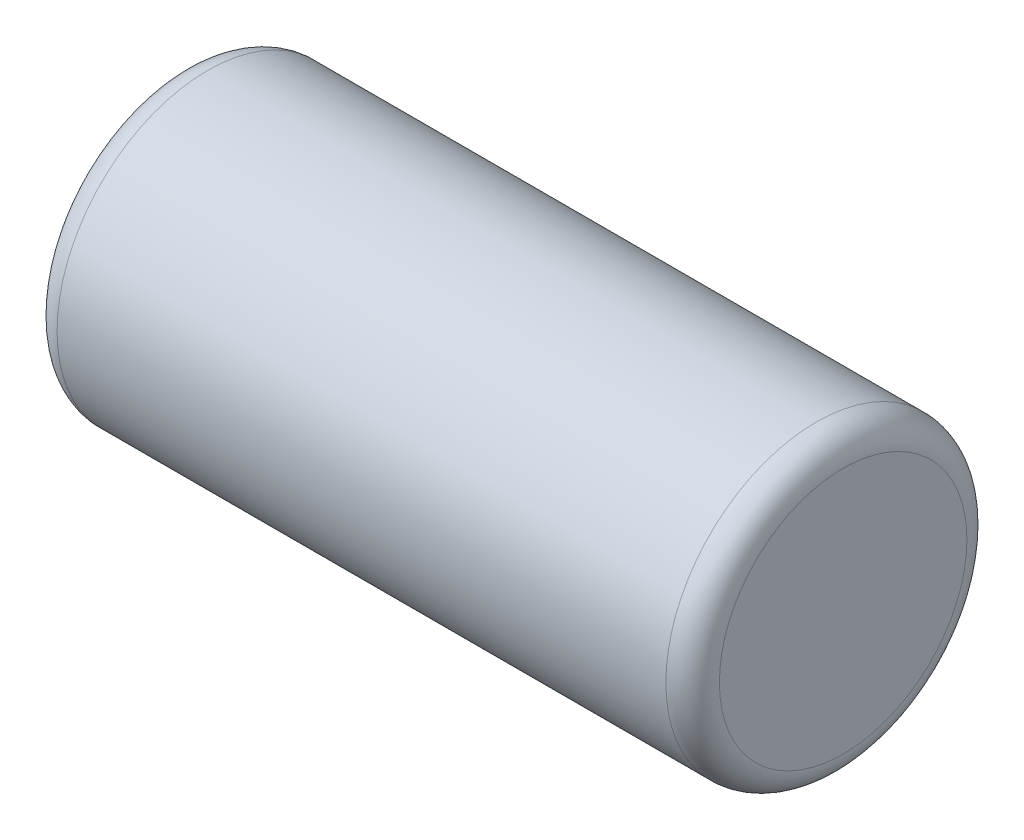
ISO-10303-21;
HEADER;
FILE_DESCRIPTION(('STEP AP214'),'2;1');
FILE_NAME('part.step','',(''),(''),'','','');
FILE_SCHEMA(('AUTOMOTIVE_DESIGN { 1 0 10303 214 1 1 1 1 }'));
ENDSEC;
DATA;
#1=APPLICATION_CONTEXT('core data for automotive mechanical design processes');
#2=APPLICATION_PROTOCOL_DEFINITION('international standard','automotive_design',2000,#1);
#3=PRODUCT_CONTEXT('',#1,'mechanical');
#4=PRODUCT('Part','Part','',(#3));
#5=PRODUCT_RELATED_PRODUCT_CATEGORY('part','',(#4));
#6=PRODUCT_DEFINITION_FORMATION('','',#4);
#7=PRODUCT_DEFINITION_CONTEXT('part definition',#1,'design');
#8=PRODUCT_DEFINITION('design','',#6,#7);
#9=PRODUCT_DEFINITION_SHAPE('','',#8);
#10=(LENGTH_UNIT() NAMED_UNIT(*) SI_UNIT(.MILLI.,.METRE.));
#11=(NAMED_UNIT(*) PLANE_ANGLE_UNIT() SI_UNIT($,.RADIAN.));
#12=(NAMED_UNIT(*) SI_UNIT($,.STERADIAN.) SOLID_ANGLE_UNIT());
#13=UNCERTAINTY_MEASURE_WITH_UNIT(LENGTH_MEASURE(1.E-05),#10,'distance_accuracy_value','');
#14=(GEOMETRIC_REPRESENTATION_CONTEXT(3) GLOBAL_UNCERTAINTY_ASSIGNED_CONTEXT((#13)) GLOBAL_UNIT_ASSIGNED_CONTEXT((#10,
#11,#12)) REPRESENTATION_CONTEXT('',''));
#15=CARTESIAN_POINT('',(0.,0.,0.));
#16=DIRECTION('',(0.,0.,1.));
#17=DIRECTION('',(1.,0.,0.));
#18=AXIS2_PLACEMENT_3D('',#15,#16,#17);
#19=CARTESIAN_POINT('',(1.35,3.75,0.));
#20=DIRECTION('',(1.,0.,0.));
#21=DIRECTION('',(0.,0.,-1.));
#22=AXIS2_PLACEMENT_3D('',#19,#20,#21);
#23=PLANE('',#22);
#24=CARTESIAN_POINT('',(1.35,3.75,0.));
#25=DIRECTION('',(-1.,0.,0.));
#26=DIRECTION('',(0.,0.,1.));
#27=AXIS2_PLACEMENT_3D('',#24,#25,#26);
#28=CIRCLE('',#27,0.6166666666667);
#29=CARTESIAN_POINT('',(1.35,3.75,0.6166666666667));
#30=VERTEX_POINT('',#29);
#31=EDGE_CURVE('E10',#30,#30,#28,.T.);
#32=ORIENTED_EDGE('',*,*,#31,.T.);
#33=EDGE_LOOP('',(#32));
#34=FACE_BOUND('',#33,.T.);
#35=ADVANCED_FACE('F31',(#34),#23,.F.);
#36=CARTESIAN_POINT('',(1.48333333333324,3.75,0.));
#37=DIRECTION('',(-1.,0.,0.));
#38=DIRECTION('',(0.,0.,1.));
#39=AXIS2_PLACEMENT_3D('',#36,#37,#38);
#40=TOROIDAL_SURFACE('',#39,0.61666666666676,0.13333333333324);
#41=ORIENTED_EDGE('',*,*,#31,.F.);
#42=EDGE_LOOP('',(#41));
#43=FACE_BOUND('',#42,.T.);
#44=CARTESIAN_POINT('',(1.4833333333333,3.75,0.));
#45=DIRECTION('',(-1.,0.,0.));
#46=DIRECTION('',(0.,0.,1.));
#47=AXIS2_PLACEMENT_3D('',#44,#45,#46);
#48=CIRCLE('',#47,0.75);
#49=CARTESIAN_POINT('',(1.4833333333333,3.75,0.75));
#50=VERTEX_POINT('',#49);
#51=EDGE_CURVE('E37',#50,#50,#48,.T.);
#52=ORIENTED_EDGE('',*,*,#51,.T.);
#53=EDGE_LOOP('',(#52));
#54=FACE_BOUND('',#53,.T.);
#55=ADVANCED_FACE('F63',(#43,#54),#40,.T.);
#56=CARTESIAN_POINT('',(50.,3.75,0.));
#57=DIRECTION('',(-1.,0.,0.));
#58=DIRECTION('',(0.,0.,1.));
#59=AXIS2_PLACEMENT_3D('',#56,#57,#58);
#60=CYLINDRICAL_SURFACE('',#59,0.75);
#61=ORIENTED_EDGE('',*,*,#51,.F.);
#62=EDGE_LOOP('',(#61));
#63=FACE_BOUND('',#62,.T.);
#64=CARTESIAN_POINT('',(4.5166666666667,3.75,0.));
#65=DIRECTION('',(-1.,0.,0.));
#66=DIRECTION('',(0.,0.,1.));
#67=AXIS2_PLACEMENT_3D('',#64,#65,#66);
#68=CIRCLE('',#67,0.75);
#69=CARTESIAN_POINT('',(4.5166666666667,3.75,0.75));
#70=VERTEX_POINT('',#69);
#71=EDGE_CURVE('E41',#70,#70,#68,.T.);
#72=ORIENTED_EDGE('',*,*,#71,.T.);
#73=EDGE_LOOP('',(#72));
#74=FACE_BOUND('',#73,.T.);
#75=ADVANCED_FACE('F59',(#63,#74),#60,.T.);
#76=CARTESIAN_POINT('',(4.51666666666676,3.75,0.));
#77=DIRECTION('',(-1.,0.,0.));
#78=DIRECTION('',(0.,0.,1.));
#79=AXIS2_PLACEMENT_3D('',#76,#77,#78);
#80=TOROIDAL_SURFACE('',#79,0.61666666666676,0.13333333333324);
#81=ORIENTED_EDGE('',*,*,#71,.F.);
#82=EDGE_LOOP('',(#81));
#83=FACE_BOUND('',#82,.T.);
#84=CARTESIAN_POINT('',(4.65,3.75,0.));
#85=DIRECTION('',(-1.,0.,0.));
#86=DIRECTION('',(0.,0.,1.));
#87=AXIS2_PLACEMENT_3D('',#84,#85,#86);
#88=CIRCLE('',#87,0.6166666666667);
#89=CARTESIAN_POINT('',(4.65,3.75,0.6166666666667));
#90=VERTEX_POINT('',#89);
#91=EDGE_CURVE('E45',#90,#90,#88,.T.);
#92=ORIENTED_EDGE('',*,*,#91,.T.);
#93=EDGE_LOOP('',(#92));
#94=FACE_BOUND('',#93,.T.);
#95=ADVANCED_FACE('F51',(#83,#94),#80,.T.);
#96=CARTESIAN_POINT('',(4.65,4.3666666666667,0.));
#97=DIRECTION('',(-1.,0.,0.));
#98=DIRECTION('',(0.,0.,1.));
#99=AXIS2_PLACEMENT_3D('',#96,#97,#98);
#100=PLANE('',#99);
#101=ORIENTED_EDGE('',*,*,#91,.F.);
#102=EDGE_LOOP('',(#101));
#103=FACE_BOUND('',#102,.T.);
#104=ADVANCED_FACE('F53',(#103),#100,.F.);
#105=CLOSED_SHELL('',(#35,#55,#75,#95,#104));
#106=MANIFOLD_SOLID_BREP('B2',#105);
#107=ADVANCED_BREP_SHAPE_REPRESENTATION('',(#18,#106),#14);
#108=SHAPE_DEFINITION_REPRESENTATION(#9,#107);
ENDSEC;
END-ISO-10303-21;
